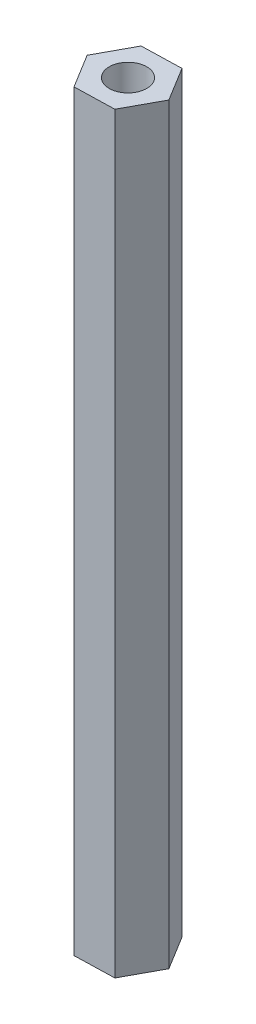
ISO-10303-21;
HEADER;
FILE_DESCRIPTION(('STEP AP214'),'2;1');
FILE_NAME('part.step','',(''),(''),'','','');
FILE_SCHEMA(('AUTOMOTIVE_DESIGN { 1 0 10303 214 1 1 1 1 }'));
ENDSEC;
DATA;
#1=APPLICATION_CONTEXT('core data for automotive mechanical design processes');
#2=APPLICATION_PROTOCOL_DEFINITION('international standard','automotive_design',2000,#1);
#3=PRODUCT_CONTEXT('',#1,'mechanical');
#4=PRODUCT('Part','Part','',(#3));
#5=PRODUCT_RELATED_PRODUCT_CATEGORY('part','',(#4));
#6=PRODUCT_DEFINITION_FORMATION('','',#4);
#7=PRODUCT_DEFINITION_CONTEXT('part definition',#1,'design');
#8=PRODUCT_DEFINITION('design','',#6,#7);
#9=PRODUCT_DEFINITION_SHAPE('','',#8);
#10=(LENGTH_UNIT() NAMED_UNIT(*) SI_UNIT(.MILLI.,.METRE.));
#11=(NAMED_UNIT(*) PLANE_ANGLE_UNIT() SI_UNIT($,.RADIAN.));
#12=(NAMED_UNIT(*) SI_UNIT($,.STERADIAN.) SOLID_ANGLE_UNIT());
#13=UNCERTAINTY_MEASURE_WITH_UNIT(LENGTH_MEASURE(1.E-05),#10,'distance_accuracy_value','');
#14=(GEOMETRIC_REPRESENTATION_CONTEXT(3) GLOBAL_UNCERTAINTY_ASSIGNED_CONTEXT((#13)) GLOBAL_UNIT_ASSIGNED_CONTEXT((#10,
#11,#12)) REPRESENTATION_CONTEXT('',''));
#15=CARTESIAN_POINT('',(0.,0.,0.));
#16=DIRECTION('',(0.,0.,1.));
#17=DIRECTION('',(1.,0.,0.));
#18=AXIS2_PLACEMENT_3D('',#15,#16,#17);
#19=CARTESIAN_POINT('',(-3.17431544114564,60.,0.0839929368322979));
#20=DIRECTION('',(0.85249693539695,0.,-0.522732221255595));
#21=DIRECTION('',(-0.522732221255595,0.,-0.85249693539695));
#22=AXIS2_PLACEMENT_3D('',#19,#20,#21);
#23=PLANE('',#22);
#24=DIRECTION('',(0.522732221255595,0.,0.85249693539695));
#25=VECTOR('',#24,1.);
#26=CARTESIAN_POINT('',(-3.17431544114564,0.,0.0839929368322979));
#27=LINE('',#26,#25);
#28=CARTESIAN_POINT('',(-3.17431544114564,0.,0.0839929368322979));
#29=VERTEX_POINT('',#28);
#30=CARTESIAN_POINT('',(-1.51441770353759,0.,2.79103428007348));
#31=VERTEX_POINT('',#30);
#32=EDGE_CURVE('E144',#29,#31,#27,.T.);
#33=ORIENTED_EDGE('',*,*,#32,.T.);
#34=DIRECTION('',(0.,-1.,0.));
#35=VECTOR('',#34,1.);
#36=CARTESIAN_POINT('',(-1.51441770353759,60.,2.79103428007348));
#37=LINE('',#36,#35);
#38=CARTESIAN_POINT('',(-1.51441770353759,60.,2.79103428007348));
#39=VERTEX_POINT('',#38);
#40=EDGE_CURVE('E13',#39,#31,#37,.T.);
#41=ORIENTED_EDGE('',*,*,#40,.F.);
#42=DIRECTION('',(0.522732221255595,0.,0.85249693539695));
#43=VECTOR('',#42,1.);
#44=CARTESIAN_POINT('',(-3.17431544114564,60.,0.0839929368322979));
#45=LINE('',#44,#43);
#46=CARTESIAN_POINT('',(-3.17431544114564,60.,0.0839929368322979));
#47=VERTEX_POINT('',#46);
#48=EDGE_CURVE('E161',#47,#39,#45,.T.);
#49=ORIENTED_EDGE('',*,*,#48,.F.);
#50=DIRECTION('',(0.,-1.,0.));
#51=VECTOR('',#50,1.);
#52=CARTESIAN_POINT('',(-3.17431544114564,60.,0.0839929368322979));
#53=LINE('',#52,#51);
#54=EDGE_CURVE('E140',#47,#29,#53,.T.);
#55=ORIENTED_EDGE('',*,*,#54,.T.);
#56=EDGE_LOOP('',(#33,#41,#49,#55));
#57=FACE_BOUND('',#56,.T.);
#58=ADVANCED_FACE('F52',(#57),#23,.F.);
#59=CARTESIAN_POINT('',(-1.51441770353759,60.,2.79103428007348));
#60=DIRECTION('',(-0.0264509152855386,0.,-0.999650113329938));
#61=DIRECTION('',(-0.999650113329938,0.,0.0264509152855386));
#62=AXIS2_PLACEMENT_3D('',#59,#60,#61);
#63=PLANE('',#62);
#64=DIRECTION('',(0.999650113329938,0.,-0.0264509152855386));
#65=VECTOR('',#64,1.);
#66=CARTESIAN_POINT('',(-1.51441770353759,0.,2.79103428007348));
#67=LINE('',#66,#65);
#68=CARTESIAN_POINT('',(1.65989773760805,0.,2.70704134324118));
#69=VERTEX_POINT('',#68);
#70=EDGE_CURVE('E148',#31,#69,#67,.T.);
#71=ORIENTED_EDGE('',*,*,#70,.T.);
#72=DIRECTION('',(0.,-1.,0.));
#73=VECTOR('',#72,1.);
#74=CARTESIAN_POINT('',(1.65989773760805,60.,2.70704134324118));
#75=LINE('',#74,#73);
#76=CARTESIAN_POINT('',(1.65989773760805,60.,2.70704134324118));
#77=VERTEX_POINT('',#76);
#78=EDGE_CURVE('E61',#77,#69,#75,.T.);
#79=ORIENTED_EDGE('',*,*,#78,.F.);
#80=DIRECTION('',(0.999650113329938,0.,-0.0264509152855386));
#81=VECTOR('',#80,1.);
#82=CARTESIAN_POINT('',(-1.51441770353759,60.,2.79103428007348));
#83=LINE('',#82,#81);
#84=EDGE_CURVE('E106',#39,#77,#83,.T.);
#85=ORIENTED_EDGE('',*,*,#84,.F.);
#86=ORIENTED_EDGE('',*,*,#40,.T.);
#87=EDGE_LOOP('',(#71,#79,#85,#86));
#88=FACE_BOUND('',#87,.T.);
#89=ADVANCED_FACE('F192',(#88),#63,.F.);
#90=CARTESIAN_POINT('',(1.65989773760805,60.,2.70704134324118));
#91=DIRECTION('',(-0.878947850682488,0.,-0.476917892074342));
#92=DIRECTION('',(-0.476917892074342,0.,0.878947850682489));
#93=AXIS2_PLACEMENT_3D('',#90,#91,#92);
#94=PLANE('',#93);
#95=DIRECTION('',(0.476917892074342,0.,-0.878947850682489));
#96=VECTOR('',#95,1.);
#97=CARTESIAN_POINT('',(1.65989773760805,0.,2.70704134324118));
#98=LINE('',#97,#96);
#99=CARTESIAN_POINT('',(3.17431544114564,0.,-0.0839929368322977));
#100=VERTEX_POINT('',#99);
#101=EDGE_CURVE('E152',#69,#100,#98,.T.);
#102=ORIENTED_EDGE('',*,*,#101,.T.);
#103=DIRECTION('',(0.,-1.,0.));
#104=VECTOR('',#103,1.);
#105=CARTESIAN_POINT('',(3.17431544114564,60.,-0.0839929368322977));
#106=LINE('',#105,#104);
#107=CARTESIAN_POINT('',(3.17431544114564,60.,-0.0839929368322977));
#108=VERTEX_POINT('',#107);
#109=EDGE_CURVE('E130',#108,#100,#106,.T.);
#110=ORIENTED_EDGE('',*,*,#109,.F.);
#111=DIRECTION('',(0.476917892074342,0.,-0.878947850682489));
#112=VECTOR('',#111,1.);
#113=CARTESIAN_POINT('',(1.65989773760805,60.,2.70704134324118));
#114=LINE('',#113,#112);
#115=EDGE_CURVE('E119',#77,#108,#114,.T.);
#116=ORIENTED_EDGE('',*,*,#115,.F.);
#117=ORIENTED_EDGE('',*,*,#78,.T.);
#118=EDGE_LOOP('',(#102,#110,#116,#117));
#119=FACE_BOUND('',#118,.T.);
#120=ADVANCED_FACE('F173',(#119),#94,.F.);
#121=CARTESIAN_POINT('',(3.17431544114564,60.,-0.0839929368322977));
#122=DIRECTION('',(-0.85249693539695,0.,0.522732221255595));
#123=DIRECTION('',(0.522732221255596,0.,0.85249693539695));
#124=AXIS2_PLACEMENT_3D('',#121,#122,#123);
#125=PLANE('',#124);
#126=DIRECTION('',(-0.522732221255596,0.,-0.85249693539695));
#127=VECTOR('',#126,1.);
#128=CARTESIAN_POINT('',(3.17431544114564,0.,-0.0839929368322977));
#129=LINE('',#128,#127);
#130=CARTESIAN_POINT('',(1.51441770353758,0.,-2.79103428007348));
#131=VERTEX_POINT('',#130);
#132=EDGE_CURVE('E128',#100,#131,#129,.T.);
#133=ORIENTED_EDGE('',*,*,#132,.T.);
#134=DIRECTION('',(0.,-1.,0.));
#135=VECTOR('',#134,1.);
#136=CARTESIAN_POINT('',(1.51441770353758,60.,-2.79103428007348));
#137=LINE('',#136,#135);
#138=CARTESIAN_POINT('',(1.51441770353758,60.,-2.79103428007348));
#139=VERTEX_POINT('',#138);
#140=EDGE_CURVE('E125',#139,#131,#137,.T.);
#141=ORIENTED_EDGE('',*,*,#140,.F.);
#142=DIRECTION('',(-0.522732221255596,0.,-0.85249693539695));
#143=VECTOR('',#142,1.);
#144=CARTESIAN_POINT('',(3.17431544114564,60.,-0.0839929368322977));
#145=LINE('',#144,#143);
#146=EDGE_CURVE('E113',#108,#139,#145,.T.);
#147=ORIENTED_EDGE('',*,*,#146,.F.);
#148=ORIENTED_EDGE('',*,*,#109,.T.);
#149=EDGE_LOOP('',(#133,#141,#147,#148));
#150=FACE_BOUND('',#149,.T.);
#151=ADVANCED_FACE('F126',(#150),#125,.F.);
#152=CARTESIAN_POINT('',(1.51441770353758,60.,-2.79103428007348));
#153=DIRECTION('',(0.026450915285539,0.,0.999650113329938));
#154=DIRECTION('',(0.999650113329938,0.,-0.026450915285539));
#155=AXIS2_PLACEMENT_3D('',#152,#153,#154);
#156=PLANE('',#155);
#157=DIRECTION('',(-0.999650113329938,0.,0.026450915285539));
#158=VECTOR('',#157,1.);
#159=CARTESIAN_POINT('',(1.51441770353758,0.,-2.79103428007348));
#160=LINE('',#159,#158);
#161=CARTESIAN_POINT('',(-1.65989773760805,0.,-2.70704134324118));
#162=VERTEX_POINT('',#161);
#163=EDGE_CURVE('E92',#131,#162,#160,.T.);
#164=ORIENTED_EDGE('',*,*,#163,.T.);
#165=DIRECTION('',(0.,-1.,0.));
#166=VECTOR('',#165,1.);
#167=CARTESIAN_POINT('',(-1.65989773760805,60.,-2.70704134324118));
#168=LINE('',#167,#166);
#169=CARTESIAN_POINT('',(-1.65989773760805,60.,-2.70704134324118));
#170=VERTEX_POINT('',#169);
#171=EDGE_CURVE('E131',#170,#162,#168,.T.);
#172=ORIENTED_EDGE('',*,*,#171,.F.);
#173=DIRECTION('',(-0.999650113329938,0.,0.026450915285539));
#174=VECTOR('',#173,1.);
#175=CARTESIAN_POINT('',(1.51441770353758,60.,-2.79103428007348));
#176=LINE('',#175,#174);
#177=EDGE_CURVE('E117',#139,#170,#176,.T.);
#178=ORIENTED_EDGE('',*,*,#177,.F.);
#179=ORIENTED_EDGE('',*,*,#140,.T.);
#180=EDGE_LOOP('',(#164,#172,#178,#179));
#181=FACE_BOUND('',#180,.T.);
#182=ADVANCED_FACE('F133',(#181),#156,.F.);
#183=CARTESIAN_POINT('',(-1.65989773760805,60.,-2.70704134324118));
#184=DIRECTION('',(0.878947850682488,0.,0.476917892074342));
#185=DIRECTION('',(0.476917892074342,0.,-0.878947850682489));
#186=AXIS2_PLACEMENT_3D('',#183,#184,#185);
#187=PLANE('',#186);
#188=DIRECTION('',(-0.476917892074342,0.,0.878947850682489));
#189=VECTOR('',#188,1.);
#190=CARTESIAN_POINT('',(-1.65989773760805,0.,-2.70704134324118));
#191=LINE('',#190,#189);
#192=EDGE_CURVE('E98',#162,#29,#191,.T.);
#193=ORIENTED_EDGE('',*,*,#192,.T.);
#194=ORIENTED_EDGE('',*,*,#54,.F.);
#195=DIRECTION('',(-0.476917892074342,0.,0.878947850682489));
#196=VECTOR('',#195,1.);
#197=CARTESIAN_POINT('',(-1.65989773760805,60.,-2.70704134324118));
#198=LINE('',#197,#196);
#199=EDGE_CURVE('E69',#170,#47,#198,.T.);
#200=ORIENTED_EDGE('',*,*,#199,.F.);
#201=ORIENTED_EDGE('',*,*,#171,.T.);
#202=EDGE_LOOP('',(#193,#194,#200,#201));
#203=FACE_BOUND('',#202,.T.);
#204=ADVANCED_FACE('F180',(#203),#187,.F.);
#205=CARTESIAN_POINT('',(0.,60.,0.));
#206=DIRECTION('',(0.,1.,0.));
#207=DIRECTION('',(0.,0.,1.));
#208=AXIS2_PLACEMENT_3D('',#205,#206,#207);
#209=PLANE('',#208);
#210=CARTESIAN_POINT('',(0.,60.,0.));
#211=DIRECTION('',(0.,1.,0.));
#212=DIRECTION('',(0.,0.,1.));
#213=AXIS2_PLACEMENT_3D('',#210,#211,#212);
#214=CIRCLE('',#213,1.5);
#215=CARTESIAN_POINT('',(0.,60.,1.5));
#216=VERTEX_POINT('',#215);
#217=EDGE_CURVE('E318',#216,#216,#214,.T.);
#218=ORIENTED_EDGE('',*,*,#217,.F.);
#219=EDGE_LOOP('',(#218));
#220=FACE_BOUND('',#219,.T.);
#221=ORIENTED_EDGE('',*,*,#48,.T.);
#222=ORIENTED_EDGE('',*,*,#84,.T.);
#223=ORIENTED_EDGE('',*,*,#115,.T.);
#224=ORIENTED_EDGE('',*,*,#146,.T.);
#225=ORIENTED_EDGE('',*,*,#177,.T.);
#226=ORIENTED_EDGE('',*,*,#199,.T.);
#227=EDGE_LOOP('',(#221,#222,#223,#224,#225,#226));
#228=FACE_BOUND('',#227,.T.);
#229=ADVANCED_FACE('F115',(#220,#228),#209,.T.);
#230=CARTESIAN_POINT('',(0.,0.,0.));
#231=DIRECTION('',(0.,1.,0.));
#232=DIRECTION('',(0.,0.,1.));
#233=AXIS2_PLACEMENT_3D('',#230,#231,#232);
#234=PLANE('',#233);
#235=CARTESIAN_POINT('',(0.,0.,0.));
#236=DIRECTION('',(0.,-1.,0.));
#237=DIRECTION('',(0.,0.,-1.));
#238=AXIS2_PLACEMENT_3D('',#235,#236,#237);
#239=CIRCLE('',#238,1.5);
#240=CARTESIAN_POINT('',(0.,0.,-1.5));
#241=VERTEX_POINT('',#240);
#242=EDGE_CURVE('E325',#241,#241,#239,.T.);
#243=ORIENTED_EDGE('',*,*,#242,.F.);
#244=EDGE_LOOP('',(#243));
#245=FACE_BOUND('',#244,.T.);
#246=ORIENTED_EDGE('',*,*,#32,.F.);
#247=ORIENTED_EDGE('',*,*,#192,.F.);
#248=ORIENTED_EDGE('',*,*,#163,.F.);
#249=ORIENTED_EDGE('',*,*,#132,.F.);
#250=ORIENTED_EDGE('',*,*,#101,.F.);
#251=ORIENTED_EDGE('',*,*,#70,.F.);
#252=EDGE_LOOP('',(#246,#247,#248,#249,#250,#251));
#253=FACE_BOUND('',#252,.T.);
#254=ADVANCED_FACE('F176',(#245,#253),#234,.F.);
#255=CARTESIAN_POINT('',(0.,50.,0.));
#256=DIRECTION('',(0.,1.,0.));
#257=DIRECTION('',(0.,0.,1.));
#258=AXIS2_PLACEMENT_3D('',#255,#256,#257);
#259=CYLINDRICAL_SURFACE('',#258,1.5);
#260=CARTESIAN_POINT('',(0.,50.,0.));
#261=DIRECTION('',(0.,1.,0.));
#262=DIRECTION('',(0.,0.,1.));
#263=AXIS2_PLACEMENT_3D('',#260,#261,#262);
#264=CIRCLE('',#263,1.5);
#265=CARTESIAN_POINT('',(0.,50.,1.5));
#266=VERTEX_POINT('',#265);
#267=EDGE_CURVE('E149',#266,#266,#264,.T.);
#268=ORIENTED_EDGE('',*,*,#267,.F.);
#269=EDGE_LOOP('',(#268));
#270=FACE_BOUND('',#269,.T.);
#271=ORIENTED_EDGE('',*,*,#217,.T.);
#272=EDGE_LOOP('',(#271));
#273=FACE_BOUND('',#272,.T.);
#274=ADVANCED_FACE('F230',(#270,#273),#259,.F.);
#275=CARTESIAN_POINT('',(0.,50.,0.));
#276=DIRECTION('',(0.,1.,0.));
#277=DIRECTION('',(0.,0.,1.));
#278=AXIS2_PLACEMENT_3D('',#275,#276,#277);
#279=PLANE('',#278);
#280=ORIENTED_EDGE('',*,*,#267,.T.);
#281=EDGE_LOOP('',(#280));
#282=FACE_BOUND('',#281,.T.);
#283=ADVANCED_FACE('F239',(#282),#279,.T.);
#284=CARTESIAN_POINT('',(0.,10.,0.));
#285=DIRECTION('',(0.,-1.,0.));
#286=DIRECTION('',(0.,0.,-1.));
#287=AXIS2_PLACEMENT_3D('',#284,#285,#286);
#288=CYLINDRICAL_SURFACE('',#287,1.5);
#289=CARTESIAN_POINT('',(0.,10.,0.));
#290=DIRECTION('',(0.,-1.,0.));
#291=DIRECTION('',(0.,0.,-1.));
#292=AXIS2_PLACEMENT_3D('',#289,#290,#291);
#293=CIRCLE('',#292,1.5);
#294=CARTESIAN_POINT('',(0.,10.,-1.5));
#295=VERTEX_POINT('',#294);
#296=EDGE_CURVE('E322',#295,#295,#293,.T.);
#297=ORIENTED_EDGE('',*,*,#296,.F.);
#298=EDGE_LOOP('',(#297));
#299=FACE_BOUND('',#298,.T.);
#300=ORIENTED_EDGE('',*,*,#242,.T.);
#301=EDGE_LOOP('',(#300));
#302=FACE_BOUND('',#301,.T.);
#303=ADVANCED_FACE('F248',(#299,#302),#288,.F.);
#304=CARTESIAN_POINT('',(0.,10.,0.));
#305=DIRECTION('',(0.,-1.,0.));
#306=DIRECTION('',(0.,0.,-1.));
#307=AXIS2_PLACEMENT_3D('',#304,#305,#306);
#308=PLANE('',#307);
#309=ORIENTED_EDGE('',*,*,#296,.T.);
#310=EDGE_LOOP('',(#309));
#311=FACE_BOUND('',#310,.T.);
#312=ADVANCED_FACE('F257',(#311),#308,.T.);
#313=CLOSED_SHELL('',(#58,#89,#120,#151,#182,#204,#229,#254,#274,#283,#303,#312));
#314=MANIFOLD_SOLID_BREP('B2',#313);
#315=ADVANCED_BREP_SHAPE_REPRESENTATION('',(#18,#314),#14);
#316=SHAPE_DEFINITION_REPRESENTATION(#9,#315);
ENDSEC;
END-ISO-10303-21;
